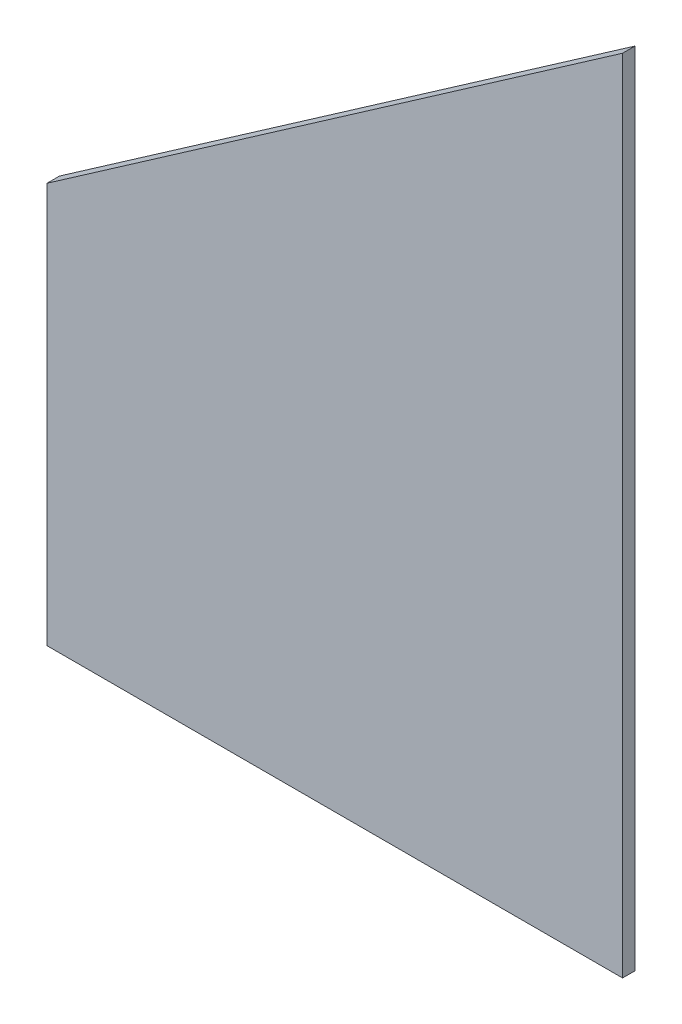
ISO-10303-21;
HEADER;
FILE_DESCRIPTION(('STEP AP214'),'2;1');
FILE_NAME('part.step','',(''),(''),'','','');
FILE_SCHEMA(('AUTOMOTIVE_DESIGN { 1 0 10303 214 1 1 1 1 }'));
ENDSEC;
DATA;
#1=APPLICATION_CONTEXT('core data for automotive mechanical design processes');
#2=APPLICATION_PROTOCOL_DEFINITION('international standard','automotive_design',2000,#1);
#3=PRODUCT_CONTEXT('',#1,'mechanical');
#4=PRODUCT('Part','Part','',(#3));
#5=PRODUCT_RELATED_PRODUCT_CATEGORY('part','',(#4));
#6=PRODUCT_DEFINITION_FORMATION('','',#4);
#7=PRODUCT_DEFINITION_CONTEXT('part definition',#1,'design');
#8=PRODUCT_DEFINITION('design','',#6,#7);
#9=PRODUCT_DEFINITION_SHAPE('','',#8);
#10=(LENGTH_UNIT() NAMED_UNIT(*) SI_UNIT(.MILLI.,.METRE.));
#11=(NAMED_UNIT(*) PLANE_ANGLE_UNIT() SI_UNIT($,.RADIAN.));
#12=(NAMED_UNIT(*) SI_UNIT($,.STERADIAN.) SOLID_ANGLE_UNIT());
#13=UNCERTAINTY_MEASURE_WITH_UNIT(LENGTH_MEASURE(1.E-05),#10,'distance_accuracy_value','');
#14=(GEOMETRIC_REPRESENTATION_CONTEXT(3) GLOBAL_UNCERTAINTY_ASSIGNED_CONTEXT((#13)) GLOBAL_UNIT_ASSIGNED_CONTEXT((#10,
#11,#12)) REPRESENTATION_CONTEXT('',''));
#15=CARTESIAN_POINT('',(0.,0.,0.));
#16=DIRECTION('',(0.,0.,1.));
#17=DIRECTION('',(1.,0.,0.));
#18=AXIS2_PLACEMENT_3D('',#15,#16,#17);
#19=CARTESIAN_POINT('',(-184.15,92.71,3.175));
#20=DIRECTION('',(0.5710644881986,-0.820905201785487,0.));
#21=DIRECTION('',(0.820905201785487,0.5710644881986,0.));
#22=AXIS2_PLACEMENT_3D('',#19,#20,#21);
#23=PLANE('',#22);
#24=DIRECTION('',(-0.820905201785487,-0.5710644881986,0.));
#25=VECTOR('',#24,1.);
#26=CARTESIAN_POINT('',(-184.15,92.71,0.));
#27=LINE('',#26,#25);
#28=CARTESIAN_POINT('',(-38.1,194.31,0.));
#29=VERTEX_POINT('',#28);
#30=CARTESIAN_POINT('',(-184.15,92.71,0.));
#31=VERTEX_POINT('',#30);
#32=EDGE_CURVE('E91',#29,#31,#27,.T.);
#33=ORIENTED_EDGE('',*,*,#32,.T.);
#34=DIRECTION('',(0.,0.,-1.));
#35=VECTOR('',#34,1.);
#36=CARTESIAN_POINT('',(-184.15,92.71,3.175));
#37=LINE('',#36,#35);
#38=CARTESIAN_POINT('',(-184.15,92.71,3.175));
#39=VERTEX_POINT('',#38);
#40=EDGE_CURVE('E45',#39,#31,#37,.T.);
#41=ORIENTED_EDGE('',*,*,#40,.F.);
#42=DIRECTION('',(-0.820905201785487,-0.5710644881986,0.));
#43=VECTOR('',#42,1.);
#44=CARTESIAN_POINT('',(-184.15,92.71,3.175));
#45=LINE('',#44,#43);
#46=CARTESIAN_POINT('',(-38.1,194.31,3.175));
#47=VERTEX_POINT('',#46);
#48=EDGE_CURVE('E84',#47,#39,#45,.T.);
#49=ORIENTED_EDGE('',*,*,#48,.F.);
#50=DIRECTION('',(0.,0.,-1.));
#51=VECTOR('',#50,1.);
#52=CARTESIAN_POINT('',(-38.1,194.31,3.175));
#53=LINE('',#52,#51);
#54=EDGE_CURVE('E11',#47,#29,#53,.T.);
#55=ORIENTED_EDGE('',*,*,#54,.T.);
#56=EDGE_LOOP('',(#33,#41,#49,#55));
#57=FACE_BOUND('',#56,.T.);
#58=ADVANCED_FACE('F37',(#57),#23,.F.);
#59=CARTESIAN_POINT('',(-184.15,-8.88999999999997,3.175));
#60=DIRECTION('',(1.,0.,0.));
#61=DIRECTION('',(0.,0.,-1.));
#62=AXIS2_PLACEMENT_3D('',#59,#60,#61);
#63=PLANE('',#62);
#64=DIRECTION('',(0.,-1.,0.));
#65=VECTOR('',#64,1.);
#66=CARTESIAN_POINT('',(-184.15,-8.88999999999997,0.));
#67=LINE('',#66,#65);
#68=CARTESIAN_POINT('',(-184.15,-8.88999999999997,0.));
#69=VERTEX_POINT('',#68);
#70=EDGE_CURVE('E71',#31,#69,#67,.T.);
#71=ORIENTED_EDGE('',*,*,#70,.T.);
#72=DIRECTION('',(0.,0.,-1.));
#73=VECTOR('',#72,1.);
#74=CARTESIAN_POINT('',(-184.15,-8.88999999999997,3.175));
#75=LINE('',#74,#73);
#76=CARTESIAN_POINT('',(-184.15,-8.88999999999997,3.175));
#77=VERTEX_POINT('',#76);
#78=EDGE_CURVE('E92',#77,#69,#75,.T.);
#79=ORIENTED_EDGE('',*,*,#78,.F.);
#80=DIRECTION('',(0.,-1.,0.));
#81=VECTOR('',#80,1.);
#82=CARTESIAN_POINT('',(-184.15,-8.88999999999997,3.175));
#83=LINE('',#82,#81);
#84=EDGE_CURVE('E88',#39,#77,#83,.T.);
#85=ORIENTED_EDGE('',*,*,#84,.F.);
#86=ORIENTED_EDGE('',*,*,#40,.T.);
#87=EDGE_LOOP('',(#71,#79,#85,#86));
#88=FACE_BOUND('',#87,.T.);
#89=ADVANCED_FACE('F93',(#88),#63,.F.);
#90=CARTESIAN_POINT('',(-184.15,-8.88999999999997,3.175));
#91=DIRECTION('',(0.,1.,0.));
#92=DIRECTION('',(0.,0.,1.));
#93=AXIS2_PLACEMENT_3D('',#90,#91,#92);
#94=PLANE('',#93);
#95=DIRECTION('',(1.,0.,0.));
#96=VECTOR('',#95,1.);
#97=CARTESIAN_POINT('',(-184.15,-8.88999999999997,0.));
#98=LINE('',#97,#96);
#99=CARTESIAN_POINT('',(-38.1,-8.88999999999997,0.));
#100=VERTEX_POINT('',#99);
#101=EDGE_CURVE('E78',#69,#100,#98,.T.);
#102=ORIENTED_EDGE('',*,*,#101,.T.);
#103=DIRECTION('',(0.,0.,-1.));
#104=VECTOR('',#103,1.);
#105=CARTESIAN_POINT('',(-38.1,-8.88999999999997,3.175));
#106=LINE('',#105,#104);
#107=CARTESIAN_POINT('',(-38.1,-8.88999999999997,3.175));
#108=VERTEX_POINT('',#107);
#109=EDGE_CURVE('E97',#108,#100,#106,.T.);
#110=ORIENTED_EDGE('',*,*,#109,.F.);
#111=DIRECTION('',(1.,0.,0.));
#112=VECTOR('',#111,1.);
#113=CARTESIAN_POINT('',(-184.15,-8.88999999999997,3.175));
#114=LINE('',#113,#112);
#115=EDGE_CURVE('E95',#77,#108,#114,.T.);
#116=ORIENTED_EDGE('',*,*,#115,.F.);
#117=ORIENTED_EDGE('',*,*,#78,.T.);
#118=EDGE_LOOP('',(#102,#110,#116,#117));
#119=FACE_BOUND('',#118,.T.);
#120=ADVANCED_FACE('F107',(#119),#94,.F.);
#121=CARTESIAN_POINT('',(-38.1,-8.88999999999997,3.175));
#122=DIRECTION('',(-1.,0.,0.));
#123=DIRECTION('',(0.,0.,1.));
#124=AXIS2_PLACEMENT_3D('',#121,#122,#123);
#125=PLANE('',#124);
#126=DIRECTION('',(0.,1.,0.));
#127=VECTOR('',#126,1.);
#128=CARTESIAN_POINT('',(-38.1,-8.88999999999997,0.));
#129=LINE('',#128,#127);
#130=EDGE_CURVE('E104',#100,#29,#129,.T.);
#131=ORIENTED_EDGE('',*,*,#130,.T.);
#132=ORIENTED_EDGE('',*,*,#54,.F.);
#133=DIRECTION('',(0.,1.,0.));
#134=VECTOR('',#133,1.);
#135=CARTESIAN_POINT('',(-38.1,194.31,3.175));
#136=LINE('',#135,#134);
#137=EDGE_CURVE('E53',#108,#47,#136,.T.);
#138=ORIENTED_EDGE('',*,*,#137,.F.);
#139=ORIENTED_EDGE('',*,*,#109,.T.);
#140=EDGE_LOOP('',(#131,#132,#138,#139));
#141=FACE_BOUND('',#140,.T.);
#142=ADVANCED_FACE('F111',(#141),#125,.F.);
#143=CARTESIAN_POINT('',(0.,0.,3.175));
#144=DIRECTION('',(0.,0.,1.));
#145=DIRECTION('',(1.,0.,0.));
#146=AXIS2_PLACEMENT_3D('',#143,#144,#145);
#147=PLANE('',#146);
#148=ORIENTED_EDGE('',*,*,#137,.T.);
#149=ORIENTED_EDGE('',*,*,#48,.T.);
#150=ORIENTED_EDGE('',*,*,#84,.T.);
#151=ORIENTED_EDGE('',*,*,#115,.T.);
#152=EDGE_LOOP('',(#148,#149,#150,#151));
#153=FACE_BOUND('',#152,.T.);
#154=ADVANCED_FACE('F86',(#153),#147,.T.);
#155=CARTESIAN_POINT('',(0.,0.,0.));
#156=DIRECTION('',(0.,0.,1.));
#157=DIRECTION('',(1.,0.,0.));
#158=AXIS2_PLACEMENT_3D('',#155,#156,#157);
#159=PLANE('',#158);
#160=ORIENTED_EDGE('',*,*,#32,.F.);
#161=ORIENTED_EDGE('',*,*,#130,.F.);
#162=ORIENTED_EDGE('',*,*,#101,.F.);
#163=ORIENTED_EDGE('',*,*,#70,.F.);
#164=EDGE_LOOP('',(#160,#161,#162,#163));
#165=FACE_BOUND('',#164,.T.);
#166=ADVANCED_FACE('F110',(#165),#159,.F.);
#167=CLOSED_SHELL('',(#58,#89,#120,#142,#154,#166));
#168=MANIFOLD_SOLID_BREP('B2',#167);
#169=ADVANCED_BREP_SHAPE_REPRESENTATION('',(#18,#168),#14);
#170=SHAPE_DEFINITION_REPRESENTATION(#9,#169);
ENDSEC;
END-ISO-10303-21;
